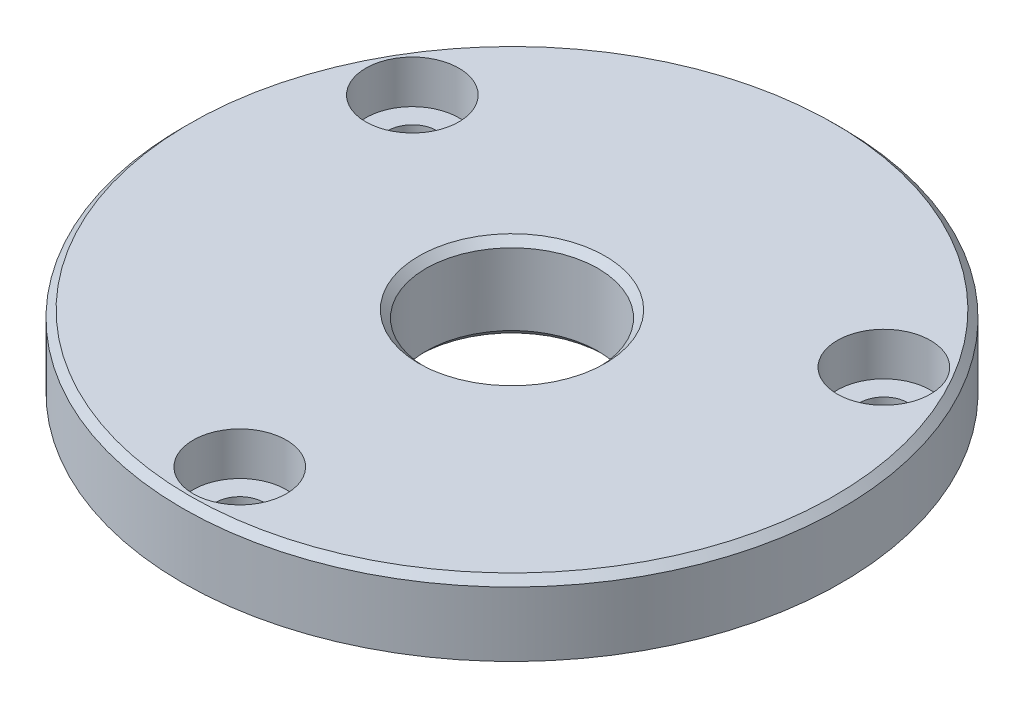
ISO-10303-21;
HEADER;
FILE_DESCRIPTION(('STEP AP214'),'2;1');
FILE_NAME('part.step','',(''),(''),'','','');
FILE_SCHEMA(('AUTOMOTIVE_DESIGN { 1 0 10303 214 1 1 1 1 }'));
ENDSEC;
DATA;
#1=APPLICATION_CONTEXT('core data for automotive mechanical design processes');
#2=APPLICATION_PROTOCOL_DEFINITION('international standard','automotive_design',2000,#1);
#3=PRODUCT_CONTEXT('',#1,'mechanical');
#4=PRODUCT('Part','Part','',(#3));
#5=PRODUCT_RELATED_PRODUCT_CATEGORY('part','',(#4));
#6=PRODUCT_DEFINITION_FORMATION('','',#4);
#7=PRODUCT_DEFINITION_CONTEXT('part definition',#1,'design');
#8=PRODUCT_DEFINITION('design','',#6,#7);
#9=PRODUCT_DEFINITION_SHAPE('','',#8);
#10=(LENGTH_UNIT() NAMED_UNIT(*) SI_UNIT(.MILLI.,.METRE.));
#11=(NAMED_UNIT(*) PLANE_ANGLE_UNIT() SI_UNIT($,.RADIAN.));
#12=(NAMED_UNIT(*) SI_UNIT($,.STERADIAN.) SOLID_ANGLE_UNIT());
#13=UNCERTAINTY_MEASURE_WITH_UNIT(LENGTH_MEASURE(1.E-05),#10,'distance_accuracy_value','');
#14=(GEOMETRIC_REPRESENTATION_CONTEXT(3) GLOBAL_UNCERTAINTY_ASSIGNED_CONTEXT((#13)) GLOBAL_UNIT_ASSIGNED_CONTEXT((#10,
#11,#12)) REPRESENTATION_CONTEXT('',''));
#15=CARTESIAN_POINT('',(0.,0.,0.));
#16=DIRECTION('',(0.,0.,1.));
#17=DIRECTION('',(1.,0.,0.));
#18=AXIS2_PLACEMENT_3D('',#15,#16,#17);
#19=CARTESIAN_POINT('',(0.,0.,0.));
#20=DIRECTION('',(0.,-1.,0.));
#21=DIRECTION('',(0.,0.,-1.));
#22=AXIS2_PLACEMENT_3D('',#19,#20,#21);
#23=CYLINDRICAL_SURFACE('',#22,15.);
#24=CARTESIAN_POINT('',(0.,0.500000000000007,0.));
#25=DIRECTION('',(0.,-1.,0.));
#26=DIRECTION('',(0.,0.,-1.));
#27=AXIS2_PLACEMENT_3D('',#24,#25,#26);
#28=CIRCLE('',#27,15.);
#29=CARTESIAN_POINT('',(0.,0.500000000000007,-15.));
#30=VERTEX_POINT('',#29);
#31=EDGE_CURVE('E88',#30,#30,#28,.F.);
#32=ORIENTED_EDGE('',*,*,#31,.T.);
#33=EDGE_LOOP('',(#32));
#34=FACE_BOUND('',#33,.T.);
#35=CARTESIAN_POINT('',(0.,3.,0.));
#36=DIRECTION('',(0.,-1.,0.));
#37=DIRECTION('',(0.,0.,-1.));
#38=AXIS2_PLACEMENT_3D('',#35,#36,#37);
#39=CIRCLE('',#38,15.);
#40=CARTESIAN_POINT('',(0.,3.,-15.));
#41=VERTEX_POINT('',#40);
#42=EDGE_CURVE('E49',#41,#41,#39,.T.);
#43=ORIENTED_EDGE('',*,*,#42,.T.);
#44=EDGE_LOOP('',(#43));
#45=FACE_BOUND('',#44,.T.);
#46=ADVANCED_FACE('F30',(#34,#45),#23,.T.);
#47=CARTESIAN_POINT('',(11.75,0.,0.));
#48=DIRECTION('',(0.,-1.,0.));
#49=DIRECTION('',(0.,0.,-1.));
#50=AXIS2_PLACEMENT_3D('',#47,#48,#49);
#51=PLANE('',#50);
#52=CARTESIAN_POINT('',(0.,0.,0.));
#53=DIRECTION('',(0.,-1.,0.));
#54=DIRECTION('',(0.,0.,-1.));
#55=AXIS2_PLACEMENT_3D('',#52,#53,#54);
#56=CIRCLE('',#55,14.7113248654052);
#57=CARTESIAN_POINT('',(0.,0.,-14.7113248654052));
#58=VERTEX_POINT('',#57);
#59=EDGE_CURVE('E85',#58,#58,#56,.T.);
#60=ORIENTED_EDGE('',*,*,#59,.T.);
#61=EDGE_LOOP('',(#60));
#62=FACE_BOUND('',#61,.T.);
#63=CARTESIAN_POINT('',(0.,0.,0.));
#64=DIRECTION('',(0.,-1.,0.));
#65=DIRECTION('',(0.,0.,-1.));
#66=AXIS2_PLACEMENT_3D('',#63,#64,#65);
#67=CIRCLE('',#66,11.75);
#68=CARTESIAN_POINT('',(0.,0.,-11.75));
#69=VERTEX_POINT('',#68);
#70=EDGE_CURVE('E82',#69,#69,#67,.T.);
#71=ORIENTED_EDGE('',*,*,#70,.F.);
#72=EDGE_LOOP('',(#71));
#73=FACE_BOUND('',#72,.T.);
#74=ADVANCED_FACE('F137',(#62,#73),#51,.T.);
#75=CARTESIAN_POINT('',(0.,0.,0.));
#76=DIRECTION('',(0.,-1.,0.));
#77=DIRECTION('',(0.,0.,-1.));
#78=AXIS2_PLACEMENT_3D('',#75,#76,#77);
#79=CYLINDRICAL_SURFACE('',#78,11.75);
#80=ORIENTED_EDGE('',*,*,#70,.T.);
#81=EDGE_LOOP('',(#80));
#82=FACE_BOUND('',#81,.T.);
#83=CARTESIAN_POINT('',(0.,2.,0.));
#84=DIRECTION('',(0.,-1.,0.));
#85=DIRECTION('',(0.,0.,-1.));
#86=AXIS2_PLACEMENT_3D('',#83,#84,#85);
#87=CIRCLE('',#86,11.75);
#88=CARTESIAN_POINT('',(0.,2.,-11.75));
#89=VERTEX_POINT('',#88);
#90=EDGE_CURVE('E79',#89,#89,#87,.T.);
#91=ORIENTED_EDGE('',*,*,#90,.F.);
#92=EDGE_LOOP('',(#91));
#93=FACE_BOUND('',#92,.T.);
#94=ADVANCED_FACE('F143',(#82,#93),#79,.F.);
#95=CARTESIAN_POINT('',(11.75,2.,0.));
#96=DIRECTION('',(0.,-1.,0.));
#97=DIRECTION('',(0.,0.,-1.));
#98=AXIS2_PLACEMENT_3D('',#95,#96,#97);
#99=PLANE('',#98);
#100=CARTESIAN_POINT('',(0.,2.,0.));
#101=DIRECTION('',(0.,-1.,0.));
#102=DIRECTION('',(0.,0.,-1.));
#103=AXIS2_PLACEMENT_3D('',#100,#101,#102);
#104=CIRCLE('',#103,6.5);
#105=CARTESIAN_POINT('',(0.,2.,-6.5));
#106=VERTEX_POINT('',#105);
#107=EDGE_CURVE('E43',#106,#106,#104,.F.);
#108=ORIENTED_EDGE('',*,*,#107,.T.);
#109=EDGE_LOOP('',(#108));
#110=FACE_BOUND('',#109,.T.);
#111=ORIENTED_EDGE('',*,*,#90,.T.);
#112=EDGE_LOOP('',(#111));
#113=FACE_BOUND('',#112,.T.);
#114=ADVANCED_FACE('F102',(#110,#113),#99,.T.);
#115=CARTESIAN_POINT('',(0.,0.,0.));
#116=DIRECTION('',(0.,-1.,0.));
#117=DIRECTION('',(0.,0.,-1.));
#118=AXIS2_PLACEMENT_3D('',#115,#116,#117);
#119=CYLINDRICAL_SURFACE('',#118,6.);
#120=CARTESIAN_POINT('',(0.,2.5,0.));
#121=DIRECTION('',(0.,-1.,0.));
#122=DIRECTION('',(0.,0.,-1.));
#123=AXIS2_PLACEMENT_3D('',#120,#121,#122);
#124=CIRCLE('',#123,6.);
#125=CARTESIAN_POINT('',(0.,2.5,-6.));
#126=VERTEX_POINT('',#125);
#127=EDGE_CURVE('E97',#126,#126,#124,.T.);
#128=ORIENTED_EDGE('',*,*,#127,.T.);
#129=EDGE_LOOP('',(#128));
#130=FACE_BOUND('',#129,.T.);
#131=CARTESIAN_POINT('',(0.,7.5,0.));
#132=DIRECTION('',(0.,1.,0.));
#133=DIRECTION('',(0.,0.,1.));
#134=AXIS2_PLACEMENT_3D('',#131,#132,#133);
#135=CIRCLE('',#134,6.);
#136=CARTESIAN_POINT('',(0.,7.5,6.));
#137=VERTEX_POINT('',#136);
#138=EDGE_CURVE('E94',#137,#137,#135,.T.);
#139=ORIENTED_EDGE('',*,*,#138,.T.);
#140=EDGE_LOOP('',(#139));
#141=FACE_BOUND('',#140,.T.);
#142=ADVANCED_FACE('F111',(#130,#141),#119,.F.);
#143=CARTESIAN_POINT('',(23.,8.,0.));
#144=DIRECTION('',(0.,1.,0.));
#145=DIRECTION('',(0.,0.,1.));
#146=AXIS2_PLACEMENT_3D('',#143,#144,#145);
#147=PLANE('',#146);
#148=CARTESIAN_POINT('',(16.4544826719044,8.,-9.49999999999985));
#149=DIRECTION('',(0.,1.,0.));
#150=DIRECTION('',(0.,0.,1.));
#151=AXIS2_PLACEMENT_3D('',#148,#149,#150);
#152=CIRCLE('',#151,3.25);
#153=CARTESIAN_POINT('',(16.4544826719044,8.,-6.24999999999985));
#154=VERTEX_POINT('',#153);
#155=EDGE_CURVE('E306',#154,#154,#152,.T.);
#156=ORIENTED_EDGE('',*,*,#155,.F.);
#157=EDGE_LOOP('',(#156));
#158=FACE_BOUND('',#157,.T.);
#159=CARTESIAN_POINT('',(-16.4544826719043,8.,-9.50000000000008));
#160=DIRECTION('',(0.,1.,0.));
#161=DIRECTION('',(0.,0.,1.));
#162=AXIS2_PLACEMENT_3D('',#159,#160,#161);
#163=CIRCLE('',#162,3.25);
#164=CARTESIAN_POINT('',(-16.4544826719043,8.,-6.25000000000008));
#165=VERTEX_POINT('',#164);
#166=EDGE_CURVE('E66',#165,#165,#163,.T.);
#167=ORIENTED_EDGE('',*,*,#166,.F.);
#168=EDGE_LOOP('',(#167));
#169=FACE_BOUND('',#168,.T.);
#170=CARTESIAN_POINT('',(0.,8.,19.));
#171=DIRECTION('',(0.,1.,0.));
#172=DIRECTION('',(0.,0.,1.));
#173=AXIS2_PLACEMENT_3D('',#170,#171,#172);
#174=CIRCLE('',#173,3.25);
#175=CARTESIAN_POINT('',(0.,8.,22.25));
#176=VERTEX_POINT('',#175);
#177=EDGE_CURVE('E53',#176,#176,#174,.T.);
#178=ORIENTED_EDGE('',*,*,#177,.F.);
#179=EDGE_LOOP('',(#178));
#180=FACE_BOUND('',#179,.T.);
#181=CARTESIAN_POINT('',(0.,8.,0.));
#182=DIRECTION('',(0.,1.,0.));
#183=DIRECTION('',(0.,0.,1.));
#184=AXIS2_PLACEMENT_3D('',#181,#182,#183);
#185=CIRCLE('',#184,22.5);
#186=CARTESIAN_POINT('',(0.,8.,22.5));
#187=VERTEX_POINT('',#186);
#188=EDGE_CURVE('E10',#187,#187,#185,.T.);
#189=ORIENTED_EDGE('',*,*,#188,.T.);
#190=EDGE_LOOP('',(#189));
#191=FACE_BOUND('',#190,.T.);
#192=CARTESIAN_POINT('',(0.,8.,0.));
#193=DIRECTION('',(0.,1.,0.));
#194=DIRECTION('',(0.,0.,1.));
#195=AXIS2_PLACEMENT_3D('',#192,#193,#194);
#196=CIRCLE('',#195,6.50000000000001);
#197=CARTESIAN_POINT('',(0.,8.,6.50000000000001));
#198=VERTEX_POINT('',#197);
#199=EDGE_CURVE('E91',#198,#198,#196,.F.);
#200=ORIENTED_EDGE('',*,*,#199,.T.);
#201=EDGE_LOOP('',(#200));
#202=FACE_BOUND('',#201,.T.);
#203=ADVANCED_FACE('F114',(#158,#169,#180,#191,#202),#147,.T.);
#204=CARTESIAN_POINT('',(0.,0.,0.));
#205=DIRECTION('',(0.,-1.,0.));
#206=DIRECTION('',(0.,0.,-1.));
#207=AXIS2_PLACEMENT_3D('',#204,#205,#206);
#208=CYLINDRICAL_SURFACE('',#207,23.);
#209=CARTESIAN_POINT('',(0.,7.50000000000001,0.));
#210=DIRECTION('',(0.,1.,0.));
#211=DIRECTION('',(0.,0.,1.));
#212=AXIS2_PLACEMENT_3D('',#209,#210,#211);
#213=CIRCLE('',#212,23.);
#214=CARTESIAN_POINT('',(0.,7.50000000000001,23.));
#215=VERTEX_POINT('',#214);
#216=EDGE_CURVE('E38',#215,#215,#213,.F.);
#217=ORIENTED_EDGE('',*,*,#216,.T.);
#218=EDGE_LOOP('',(#217));
#219=FACE_BOUND('',#218,.T.);
#220=CARTESIAN_POINT('',(0.,3.,0.));
#221=DIRECTION('',(0.,-1.,0.));
#222=DIRECTION('',(0.,0.,-1.));
#223=AXIS2_PLACEMENT_3D('',#220,#221,#222);
#224=CIRCLE('',#223,23.);
#225=CARTESIAN_POINT('',(0.,3.,-23.));
#226=VERTEX_POINT('',#225);
#227=EDGE_CURVE('E76',#226,#226,#224,.T.);
#228=ORIENTED_EDGE('',*,*,#227,.F.);
#229=EDGE_LOOP('',(#228));
#230=FACE_BOUND('',#229,.T.);
#231=ADVANCED_FACE('F125',(#219,#230),#208,.T.);
#232=CARTESIAN_POINT('',(15.,3.,0.));
#233=DIRECTION('',(0.,-1.,0.));
#234=DIRECTION('',(0.,0.,-1.));
#235=AXIS2_PLACEMENT_3D('',#232,#233,#234);
#236=PLANE('',#235);
#237=CARTESIAN_POINT('',(16.4544826719044,3.,-9.49999999999985));
#238=DIRECTION('',(0.,-1.,0.));
#239=DIRECTION('',(0.,0.,-1.));
#240=AXIS2_PLACEMENT_3D('',#237,#238,#239);
#241=CIRCLE('',#240,1.7);
#242=CARTESIAN_POINT('',(16.4544826719044,3.,-11.1999999999998));
#243=VERTEX_POINT('',#242);
#244=EDGE_CURVE('E34',#243,#243,#241,.T.);
#245=ORIENTED_EDGE('',*,*,#244,.F.);
#246=EDGE_LOOP('',(#245));
#247=FACE_BOUND('',#246,.T.);
#248=CARTESIAN_POINT('',(-16.4544826719043,3.,-9.50000000000008));
#249=DIRECTION('',(0.,-1.,0.));
#250=DIRECTION('',(0.,0.,-1.));
#251=AXIS2_PLACEMENT_3D('',#248,#249,#250);
#252=CIRCLE('',#251,1.7);
#253=CARTESIAN_POINT('',(-16.4544826719043,3.,-11.2000000000001));
#254=VERTEX_POINT('',#253);
#255=EDGE_CURVE('E51',#254,#254,#252,.T.);
#256=ORIENTED_EDGE('',*,*,#255,.F.);
#257=EDGE_LOOP('',(#256));
#258=FACE_BOUND('',#257,.T.);
#259=CARTESIAN_POINT('',(0.,3.,19.));
#260=DIRECTION('',(0.,-1.,0.));
#261=DIRECTION('',(0.,0.,-1.));
#262=AXIS2_PLACEMENT_3D('',#259,#260,#261);
#263=CIRCLE('',#262,1.7);
#264=CARTESIAN_POINT('',(0.,3.,17.3));
#265=VERTEX_POINT('',#264);
#266=EDGE_CURVE('E47',#265,#265,#263,.T.);
#267=ORIENTED_EDGE('',*,*,#266,.F.);
#268=EDGE_LOOP('',(#267));
#269=FACE_BOUND('',#268,.T.);
#270=ORIENTED_EDGE('',*,*,#227,.T.);
#271=EDGE_LOOP('',(#270));
#272=FACE_BOUND('',#271,.T.);
#273=ORIENTED_EDGE('',*,*,#42,.F.);
#274=EDGE_LOOP('',(#273));
#275=FACE_BOUND('',#274,.T.);
#276=ADVANCED_FACE('F131',(#247,#258,#269,#272,#275),#236,.T.);
#277=CARTESIAN_POINT('',(0.,0.,0.));
#278=DIRECTION('',(0.,1.,0.));
#279=DIRECTION('',(0.,0.,1.));
#280=AXIS2_PLACEMENT_3D('',#277,#278,#279);
#281=CONICAL_SURFACE('',#280,14.7113248654052,0.523598775598308);
#282=ORIENTED_EDGE('',*,*,#31,.F.);
#283=EDGE_LOOP('',(#282));
#284=FACE_BOUND('',#283,.T.);
#285=ORIENTED_EDGE('',*,*,#59,.F.);
#286=EDGE_LOOP('',(#285));
#287=FACE_BOUND('',#286,.T.);
#288=ADVANCED_FACE('F120',(#284,#287),#281,.T.);
#289=CARTESIAN_POINT('',(0.,8.,0.));
#290=DIRECTION('',(0.,1.,0.));
#291=DIRECTION('',(0.,0.,1.));
#292=AXIS2_PLACEMENT_3D('',#289,#290,#291);
#293=CONICAL_SURFACE('',#292,6.50000000000001,0.785398163397447);
#294=ORIENTED_EDGE('',*,*,#138,.F.);
#295=EDGE_LOOP('',(#294));
#296=FACE_BOUND('',#295,.T.);
#297=ORIENTED_EDGE('',*,*,#199,.F.);
#298=EDGE_LOOP('',(#297));
#299=FACE_BOUND('',#298,.T.);
#300=ADVANCED_FACE('F108',(#296,#299),#293,.F.);
#301=CARTESIAN_POINT('',(0.,2.5,0.));
#302=DIRECTION('',(0.,-1.,0.));
#303=DIRECTION('',(0.,0.,-1.));
#304=AXIS2_PLACEMENT_3D('',#301,#302,#303);
#305=CONICAL_SURFACE('',#304,6.,0.785398163397448);
#306=ORIENTED_EDGE('',*,*,#107,.F.);
#307=EDGE_LOOP('',(#306));
#308=FACE_BOUND('',#307,.T.);
#309=ORIENTED_EDGE('',*,*,#127,.F.);
#310=EDGE_LOOP('',(#309));
#311=FACE_BOUND('',#310,.T.);
#312=ADVANCED_FACE('F105',(#308,#311),#305,.F.);
#313=CARTESIAN_POINT('',(0.,7.50000000000001,0.));
#314=DIRECTION('',(0.,-1.,0.));
#315=DIRECTION('',(0.,0.,-1.));
#316=AXIS2_PLACEMENT_3D('',#313,#314,#315);
#317=CONICAL_SURFACE('',#316,23.,0.785398163397448);
#318=ORIENTED_EDGE('',*,*,#188,.F.);
#319=EDGE_LOOP('',(#318));
#320=FACE_BOUND('',#319,.T.);
#321=ORIENTED_EDGE('',*,*,#216,.F.);
#322=EDGE_LOOP('',(#321));
#323=FACE_BOUND('',#322,.T.);
#324=ADVANCED_FACE('F32',(#320,#323),#317,.T.);
#325=CARTESIAN_POINT('',(0.,8.,19.));
#326=DIRECTION('',(0.,1.,0.));
#327=DIRECTION('',(0.,0.,1.));
#328=AXIS2_PLACEMENT_3D('',#325,#326,#327);
#329=CYLINDRICAL_SURFACE('',#328,1.7);
#330=ORIENTED_EDGE('',*,*,#266,.T.);
#331=EDGE_LOOP('',(#330));
#332=FACE_BOUND('',#331,.T.);
#333=CARTESIAN_POINT('',(0.,5.,19.));
#334=DIRECTION('',(0.,1.,0.));
#335=DIRECTION('',(0.,0.,1.));
#336=AXIS2_PLACEMENT_3D('',#333,#334,#335);
#337=CIRCLE('',#336,1.7);
#338=CARTESIAN_POINT('',(0.,5.,20.7));
#339=VERTEX_POINT('',#338);
#340=EDGE_CURVE('E50',#339,#339,#337,.T.);
#341=ORIENTED_EDGE('',*,*,#340,.T.);
#342=EDGE_LOOP('',(#341));
#343=FACE_BOUND('',#342,.T.);
#344=ADVANCED_FACE('F200',(#332,#343),#329,.F.);
#345=CARTESIAN_POINT('',(1.7,5.,19.));
#346=DIRECTION('',(0.,-1.,0.));
#347=DIRECTION('',(0.,0.,-1.));
#348=AXIS2_PLACEMENT_3D('',#345,#346,#347);
#349=PLANE('',#348);
#350=ORIENTED_EDGE('',*,*,#340,.F.);
#351=EDGE_LOOP('',(#350));
#352=FACE_BOUND('',#351,.T.);
#353=CARTESIAN_POINT('',(0.,5.,19.));
#354=DIRECTION('',(0.,1.,0.));
#355=DIRECTION('',(0.,0.,1.));
#356=AXIS2_PLACEMENT_3D('',#353,#354,#355);
#357=CIRCLE('',#356,3.25);
#358=CARTESIAN_POINT('',(0.,5.,22.25));
#359=VERTEX_POINT('',#358);
#360=EDGE_CURVE('E58',#359,#359,#357,.T.);
#361=ORIENTED_EDGE('',*,*,#360,.T.);
#362=EDGE_LOOP('',(#361));
#363=FACE_BOUND('',#362,.T.);
#364=ADVANCED_FACE('F209',(#352,#363),#349,.F.);
#365=CARTESIAN_POINT('',(0.,8.,19.));
#366=DIRECTION('',(0.,1.,0.));
#367=DIRECTION('',(0.,0.,1.));
#368=AXIS2_PLACEMENT_3D('',#365,#366,#367);
#369=CYLINDRICAL_SURFACE('',#368,3.25);
#370=ORIENTED_EDGE('',*,*,#360,.F.);
#371=EDGE_LOOP('',(#370));
#372=FACE_BOUND('',#371,.T.);
#373=ORIENTED_EDGE('',*,*,#177,.T.);
#374=EDGE_LOOP('',(#373));
#375=FACE_BOUND('',#374,.T.);
#376=ADVANCED_FACE('F219',(#372,#375),#369,.F.);
#377=CARTESIAN_POINT('',(-16.4544826719043,8.,-9.50000000000008));
#378=DIRECTION('',(0.,1.,0.));
#379=DIRECTION('',(0.,0.,1.));
#380=AXIS2_PLACEMENT_3D('',#377,#378,#379);
#381=CYLINDRICAL_SURFACE('',#380,1.7);
#382=ORIENTED_EDGE('',*,*,#255,.T.);
#383=EDGE_LOOP('',(#382));
#384=FACE_BOUND('',#383,.T.);
#385=CARTESIAN_POINT('',(-16.4544826719043,5.,-9.50000000000008));
#386=DIRECTION('',(0.,1.,0.));
#387=DIRECTION('',(0.,0.,1.));
#388=AXIS2_PLACEMENT_3D('',#385,#386,#387);
#389=CIRCLE('',#388,1.7);
#390=CARTESIAN_POINT('',(-16.4544826719043,5.,-7.80000000000008));
#391=VERTEX_POINT('',#390);
#392=EDGE_CURVE('E54',#391,#391,#389,.T.);
#393=ORIENTED_EDGE('',*,*,#392,.T.);
#394=EDGE_LOOP('',(#393));
#395=FACE_BOUND('',#394,.T.);
#396=ADVANCED_FACE('F228',(#384,#395),#381,.F.);
#397=CARTESIAN_POINT('',(-14.7544826719043,5.,-9.50000000000008));
#398=DIRECTION('',(0.,-1.,0.));
#399=DIRECTION('',(0.,0.,-1.));
#400=AXIS2_PLACEMENT_3D('',#397,#398,#399);
#401=PLANE('',#400);
#402=ORIENTED_EDGE('',*,*,#392,.F.);
#403=EDGE_LOOP('',(#402));
#404=FACE_BOUND('',#403,.T.);
#405=CARTESIAN_POINT('',(-16.4544826719043,5.,-9.50000000000008));
#406=DIRECTION('',(0.,1.,0.));
#407=DIRECTION('',(0.,0.,1.));
#408=AXIS2_PLACEMENT_3D('',#405,#406,#407);
#409=CIRCLE('',#408,3.25);
#410=CARTESIAN_POINT('',(-16.4544826719043,5.,-6.25000000000008));
#411=VERTEX_POINT('',#410);
#412=EDGE_CURVE('E61',#411,#411,#409,.T.);
#413=ORIENTED_EDGE('',*,*,#412,.T.);
#414=EDGE_LOOP('',(#413));
#415=FACE_BOUND('',#414,.T.);
#416=ADVANCED_FACE('F248',(#404,#415),#401,.F.);
#417=CARTESIAN_POINT('',(-16.4544826719043,8.,-9.50000000000008));
#418=DIRECTION('',(0.,1.,0.));
#419=DIRECTION('',(0.,0.,1.));
#420=AXIS2_PLACEMENT_3D('',#417,#418,#419);
#421=CYLINDRICAL_SURFACE('',#420,3.25);
#422=ORIENTED_EDGE('',*,*,#412,.F.);
#423=EDGE_LOOP('',(#422));
#424=FACE_BOUND('',#423,.T.);
#425=ORIENTED_EDGE('',*,*,#166,.T.);
#426=EDGE_LOOP('',(#425));
#427=FACE_BOUND('',#426,.T.);
#428=ADVANCED_FACE('F257',(#424,#427),#421,.F.);
#429=CARTESIAN_POINT('',(16.4544826719044,8.,-9.49999999999985));
#430=DIRECTION('',(0.,1.,0.));
#431=DIRECTION('',(0.,0.,1.));
#432=AXIS2_PLACEMENT_3D('',#429,#430,#431);
#433=CYLINDRICAL_SURFACE('',#432,1.7);
#434=ORIENTED_EDGE('',*,*,#244,.T.);
#435=EDGE_LOOP('',(#434));
#436=FACE_BOUND('',#435,.T.);
#437=CARTESIAN_POINT('',(16.4544826719044,5.,-9.49999999999985));
#438=DIRECTION('',(0.,1.,0.));
#439=DIRECTION('',(0.,0.,1.));
#440=AXIS2_PLACEMENT_3D('',#437,#438,#439);
#441=CIRCLE('',#440,1.7);
#442=CARTESIAN_POINT('',(16.4544826719044,5.,-7.79999999999985));
#443=VERTEX_POINT('',#442);
#444=EDGE_CURVE('E308',#443,#443,#441,.T.);
#445=ORIENTED_EDGE('',*,*,#444,.T.);
#446=EDGE_LOOP('',(#445));
#447=FACE_BOUND('',#446,.T.);
#448=ADVANCED_FACE('F267',(#436,#447),#433,.F.);
#449=CARTESIAN_POINT('',(18.1544826719044,5.,-9.49999999999985));
#450=DIRECTION('',(0.,-1.,0.));
#451=DIRECTION('',(0.,0.,-1.));
#452=AXIS2_PLACEMENT_3D('',#449,#450,#451);
#453=PLANE('',#452);
#454=ORIENTED_EDGE('',*,*,#444,.F.);
#455=EDGE_LOOP('',(#454));
#456=FACE_BOUND('',#455,.T.);
#457=CARTESIAN_POINT('',(16.4544826719044,5.,-9.49999999999985));
#458=DIRECTION('',(0.,1.,0.));
#459=DIRECTION('',(0.,0.,1.));
#460=AXIS2_PLACEMENT_3D('',#457,#458,#459);
#461=CIRCLE('',#460,3.25);
#462=CARTESIAN_POINT('',(16.4544826719044,5.,-6.24999999999985));
#463=VERTEX_POINT('',#462);
#464=EDGE_CURVE('E304',#463,#463,#461,.T.);
#465=ORIENTED_EDGE('',*,*,#464,.T.);
#466=EDGE_LOOP('',(#465));
#467=FACE_BOUND('',#466,.T.);
#468=ADVANCED_FACE('F277',(#456,#467),#453,.F.);
#469=CARTESIAN_POINT('',(16.4544826719044,8.,-9.49999999999985));
#470=DIRECTION('',(0.,1.,0.));
#471=DIRECTION('',(0.,0.,1.));
#472=AXIS2_PLACEMENT_3D('',#469,#470,#471);
#473=CYLINDRICAL_SURFACE('',#472,3.25);
#474=ORIENTED_EDGE('',*,*,#464,.F.);
#475=EDGE_LOOP('',(#474));
#476=FACE_BOUND('',#475,.T.);
#477=ORIENTED_EDGE('',*,*,#155,.T.);
#478=EDGE_LOOP('',(#477));
#479=FACE_BOUND('',#478,.T.);
#480=ADVANCED_FACE('F287',(#476,#479),#473,.F.);
#481=CLOSED_SHELL('',(#46,#74,#94,#114,#142,#203,#231,#276,#288,#300,#312,#324,#344,#364,#376,
#396,#416,#428,#448,#468,#480));
#482=MANIFOLD_SOLID_BREP('B2',#481);
#483=ADVANCED_BREP_SHAPE_REPRESENTATION('',(#18,#482),#14);
#484=SHAPE_DEFINITION_REPRESENTATION(#9,#483);
ENDSEC;
END-ISO-10303-21;
